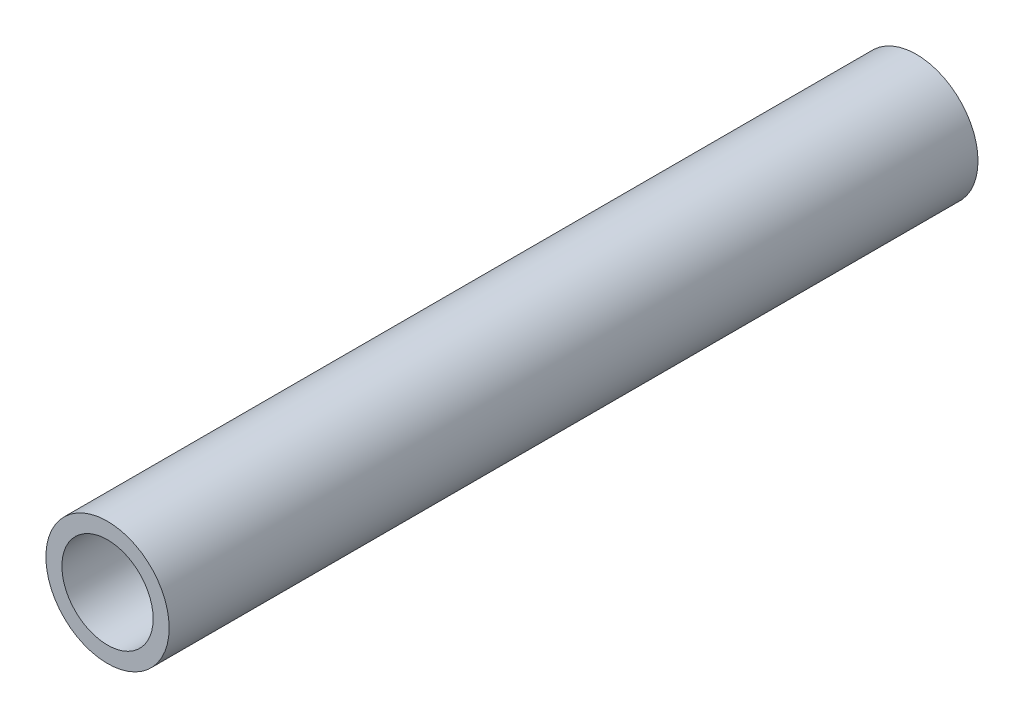
ISO-10303-21;
HEADER;
FILE_DESCRIPTION(('STEP AP214'),'2;1');
FILE_NAME('part.step','',(''),(''),'','','');
FILE_SCHEMA(('AUTOMOTIVE_DESIGN { 1 0 10303 214 1 1 1 1 }'));
ENDSEC;
DATA;
#1=APPLICATION_CONTEXT('core data for automotive mechanical design processes');
#2=APPLICATION_PROTOCOL_DEFINITION('international standard','automotive_design',2000,#1);
#3=PRODUCT_CONTEXT('',#1,'mechanical');
#4=PRODUCT('Part','Part','',(#3));
#5=PRODUCT_RELATED_PRODUCT_CATEGORY('part','',(#4));
#6=PRODUCT_DEFINITION_FORMATION('','',#4);
#7=PRODUCT_DEFINITION_CONTEXT('part definition',#1,'design');
#8=PRODUCT_DEFINITION('design','',#6,#7);
#9=PRODUCT_DEFINITION_SHAPE('','',#8);
#10=(LENGTH_UNIT() NAMED_UNIT(*) SI_UNIT(.MILLI.,.METRE.));
#11=(NAMED_UNIT(*) PLANE_ANGLE_UNIT() SI_UNIT($,.RADIAN.));
#12=(NAMED_UNIT(*) SI_UNIT($,.STERADIAN.) SOLID_ANGLE_UNIT());
#13=UNCERTAINTY_MEASURE_WITH_UNIT(LENGTH_MEASURE(1.E-05),#10,'distance_accuracy_value','');
#14=(GEOMETRIC_REPRESENTATION_CONTEXT(3) GLOBAL_UNCERTAINTY_ASSIGNED_CONTEXT((#13)) GLOBAL_UNIT_ASSIGNED_CONTEXT((#10,
#11,#12)) REPRESENTATION_CONTEXT('',''));
#15=CARTESIAN_POINT('',(0.,0.,0.));
#16=DIRECTION('',(0.,0.,1.));
#17=DIRECTION('',(1.,0.,0.));
#18=AXIS2_PLACEMENT_3D('',#15,#16,#17);
#19=CARTESIAN_POINT('',(0.,0.,70.));
#20=DIRECTION('',(0.,0.,1.));
#21=DIRECTION('',(1.,0.,0.));
#22=AXIS2_PLACEMENT_3D('',#19,#20,#21);
#23=PLANE('',#22);
#24=CARTESIAN_POINT('',(0.,0.,70.));
#25=DIRECTION('',(0.,0.,1.));
#26=DIRECTION('',(1.,0.,0.));
#27=AXIS2_PLACEMENT_3D('',#24,#25,#26);
#28=CIRCLE('',#27,10.668);
#29=CARTESIAN_POINT('',(10.668,0.,70.));
#30=VERTEX_POINT('',#29);
#31=EDGE_CURVE('E11',#30,#30,#28,.T.);
#32=ORIENTED_EDGE('',*,*,#31,.T.);
#33=EDGE_LOOP('',(#32));
#34=FACE_BOUND('',#33,.T.);
#35=CARTESIAN_POINT('',(0.,0.,70.));
#36=DIRECTION('',(0.,0.,1.));
#37=DIRECTION('',(1.,0.,0.));
#38=AXIS2_PLACEMENT_3D('',#35,#36,#37);
#39=CIRCLE('',#38,7.8994);
#40=CARTESIAN_POINT('',(7.8994,0.,70.));
#41=VERTEX_POINT('',#40);
#42=EDGE_CURVE('E48',#41,#41,#39,.T.);
#43=ORIENTED_EDGE('',*,*,#42,.F.);
#44=EDGE_LOOP('',(#43));
#45=FACE_BOUND('',#44,.T.);
#46=ADVANCED_FACE('F37',(#34,#45),#23,.T.);
#47=CARTESIAN_POINT('',(0.,0.,-70.));
#48=DIRECTION('',(0.,0.,1.));
#49=DIRECTION('',(1.,0.,0.));
#50=AXIS2_PLACEMENT_3D('',#47,#48,#49);
#51=PLANE('',#50);
#52=CARTESIAN_POINT('',(0.,0.,-70.));
#53=DIRECTION('',(0.,0.,1.));
#54=DIRECTION('',(1.,0.,0.));
#55=AXIS2_PLACEMENT_3D('',#52,#53,#54);
#56=CIRCLE('',#55,10.668);
#57=CARTESIAN_POINT('',(10.668,0.,-70.));
#58=VERTEX_POINT('',#57);
#59=EDGE_CURVE('E41',#58,#58,#56,.T.);
#60=ORIENTED_EDGE('',*,*,#59,.F.);
#61=EDGE_LOOP('',(#60));
#62=FACE_BOUND('',#61,.T.);
#63=CARTESIAN_POINT('',(0.,0.,-70.));
#64=DIRECTION('',(0.,0.,1.));
#65=DIRECTION('',(1.,0.,0.));
#66=AXIS2_PLACEMENT_3D('',#63,#64,#65);
#67=CIRCLE('',#66,7.8994);
#68=CARTESIAN_POINT('',(7.8994,0.,-70.));
#69=VERTEX_POINT('',#68);
#70=EDGE_CURVE('E50',#69,#69,#67,.T.);
#71=ORIENTED_EDGE('',*,*,#70,.T.);
#72=EDGE_LOOP('',(#71));
#73=FACE_BOUND('',#72,.T.);
#74=ADVANCED_FACE('F60',(#62,#73),#51,.F.);
#75=CARTESIAN_POINT('',(0.,0.,70.));
#76=DIRECTION('',(0.,0.,-1.));
#77=DIRECTION('',(-1.,0.,0.));
#78=AXIS2_PLACEMENT_3D('',#75,#76,#77);
#79=CYLINDRICAL_SURFACE('',#78,10.668);
#80=ORIENTED_EDGE('',*,*,#31,.F.);
#81=EDGE_LOOP('',(#80));
#82=FACE_BOUND('',#81,.T.);
#83=ORIENTED_EDGE('',*,*,#59,.T.);
#84=EDGE_LOOP('',(#83));
#85=FACE_BOUND('',#84,.T.);
#86=ADVANCED_FACE('F39',(#82,#85),#79,.T.);
#87=CARTESIAN_POINT('',(0.,0.,70.));
#88=DIRECTION('',(0.,0.,-1.));
#89=DIRECTION('',(-1.,0.,0.));
#90=AXIS2_PLACEMENT_3D('',#87,#88,#89);
#91=CYLINDRICAL_SURFACE('',#90,7.8994);
#92=ORIENTED_EDGE('',*,*,#42,.T.);
#93=EDGE_LOOP('',(#92));
#94=FACE_BOUND('',#93,.T.);
#95=ORIENTED_EDGE('',*,*,#70,.F.);
#96=EDGE_LOOP('',(#95));
#97=FACE_BOUND('',#96,.T.);
#98=ADVANCED_FACE('F56',(#94,#97),#91,.F.);
#99=CLOSED_SHELL('',(#46,#74,#86,#98));
#100=MANIFOLD_SOLID_BREP('B2',#99);
#101=ADVANCED_BREP_SHAPE_REPRESENTATION('',(#18,#100),#14);
#102=SHAPE_DEFINITION_REPRESENTATION(#9,#101);
ENDSEC;
END-ISO-10303-21;
